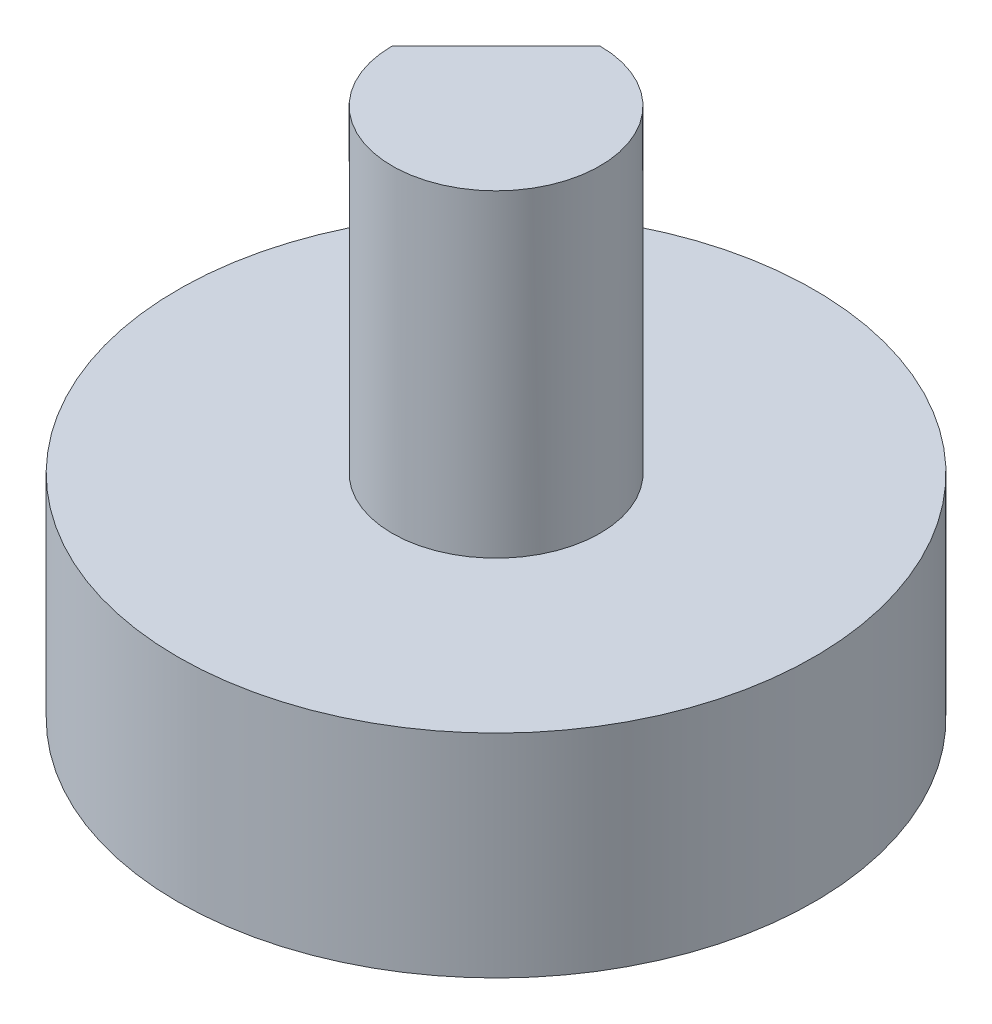
ISO-10303-21;
HEADER;
FILE_DESCRIPTION(('STEP AP214'),'2;1');
FILE_NAME('part.step','',(''),(''),'','','');
FILE_SCHEMA(('AUTOMOTIVE_DESIGN { 1 0 10303 214 1 1 1 1 }'));
ENDSEC;
DATA;
#1=APPLICATION_CONTEXT('core data for automotive mechanical design processes');
#2=APPLICATION_PROTOCOL_DEFINITION('international standard','automotive_design',2000,#1);
#3=PRODUCT_CONTEXT('',#1,'mechanical');
#4=PRODUCT('Part','Part','',(#3));
#5=PRODUCT_RELATED_PRODUCT_CATEGORY('part','',(#4));
#6=PRODUCT_DEFINITION_FORMATION('','',#4);
#7=PRODUCT_DEFINITION_CONTEXT('part definition',#1,'design');
#8=PRODUCT_DEFINITION('design','',#6,#7);
#9=PRODUCT_DEFINITION_SHAPE('','',#8);
#10=(LENGTH_UNIT() NAMED_UNIT(*) SI_UNIT(.MILLI.,.METRE.));
#11=(NAMED_UNIT(*) PLANE_ANGLE_UNIT() SI_UNIT($,.RADIAN.));
#12=(NAMED_UNIT(*) SI_UNIT($,.STERADIAN.) SOLID_ANGLE_UNIT());
#13=UNCERTAINTY_MEASURE_WITH_UNIT(LENGTH_MEASURE(1.E-05),#10,'distance_accuracy_value','');
#14=(GEOMETRIC_REPRESENTATION_CONTEXT(3) GLOBAL_UNCERTAINTY_ASSIGNED_CONTEXT((#13)) GLOBAL_UNIT_ASSIGNED_CONTEXT((#10,
#11,#12)) REPRESENTATION_CONTEXT('',''));
#15=CARTESIAN_POINT('',(0.,0.,0.));
#16=DIRECTION('',(0.,0.,1.));
#17=DIRECTION('',(1.,0.,0.));
#18=AXIS2_PLACEMENT_3D('',#15,#16,#17);
#19=CARTESIAN_POINT('',(0.,10.,0.));
#20=DIRECTION('',(0.,-1.,0.));
#21=DIRECTION('',(0.,0.,-1.));
#22=AXIS2_PLACEMENT_3D('',#19,#20,#21);
#23=CYLINDRICAL_SURFACE('',#22,15.);
#24=CARTESIAN_POINT('',(0.,10.,0.));
#25=DIRECTION('',(0.,1.,0.));
#26=DIRECTION('',(0.,0.,1.));
#27=AXIS2_PLACEMENT_3D('',#24,#25,#26);
#28=CIRCLE('',#27,15.);
#29=CARTESIAN_POINT('',(0.,10.,15.));
#30=VERTEX_POINT('',#29);
#31=EDGE_CURVE('E48',#30,#30,#28,.T.);
#32=ORIENTED_EDGE('',*,*,#31,.F.);
#33=EDGE_LOOP('',(#32));
#34=FACE_BOUND('',#33,.T.);
#35=CARTESIAN_POINT('',(0.,0.,0.));
#36=DIRECTION('',(0.,1.,0.));
#37=DIRECTION('',(0.,0.,1.));
#38=AXIS2_PLACEMENT_3D('',#35,#36,#37);
#39=CIRCLE('',#38,15.);
#40=CARTESIAN_POINT('',(0.,0.,15.));
#41=VERTEX_POINT('',#40);
#42=EDGE_CURVE('E42',#41,#41,#39,.T.);
#43=ORIENTED_EDGE('',*,*,#42,.T.);
#44=EDGE_LOOP('',(#43));
#45=FACE_BOUND('',#44,.T.);
#46=ADVANCED_FACE('F39',(#34,#45),#23,.T.);
#47=CARTESIAN_POINT('',(0.,10.,0.));
#48=DIRECTION('',(0.,1.,0.));
#49=DIRECTION('',(0.,0.,1.));
#50=AXIS2_PLACEMENT_3D('',#47,#48,#49);
#51=PLANE('',#50);
#52=CARTESIAN_POINT('',(0.,10.,0.));
#53=DIRECTION('',(0.,1.,0.));
#54=DIRECTION('',(0.,0.,1.));
#55=AXIS2_PLACEMENT_3D('',#52,#53,#54);
#56=CIRCLE('',#55,4.9);
#57=CARTESIAN_POINT('',(0.,10.,4.9));
#58=VERTEX_POINT('',#57);
#59=EDGE_CURVE('E11',#58,#58,#56,.T.);
#60=ORIENTED_EDGE('',*,*,#59,.F.);
#61=EDGE_LOOP('',(#60));
#62=FACE_BOUND('',#61,.T.);
#63=ORIENTED_EDGE('',*,*,#31,.T.);
#64=EDGE_LOOP('',(#63));
#65=FACE_BOUND('',#64,.T.);
#66=ADVANCED_FACE('F92',(#62,#65),#51,.T.);
#67=CARTESIAN_POINT('',(0.,0.,0.));
#68=DIRECTION('',(0.,1.,0.));
#69=DIRECTION('',(0.,0.,1.));
#70=AXIS2_PLACEMENT_3D('',#67,#68,#69);
#71=PLANE('',#70);
#72=ORIENTED_EDGE('',*,*,#42,.F.);
#73=EDGE_LOOP('',(#72));
#74=FACE_BOUND('',#73,.T.);
#75=ADVANCED_FACE('F98',(#74),#71,.F.);
#76=CARTESIAN_POINT('',(0.,25.,0.));
#77=DIRECTION('',(0.,-1.,0.));
#78=DIRECTION('',(0.,0.,-1.));
#79=AXIS2_PLACEMENT_3D('',#76,#77,#78);
#80=CYLINDRICAL_SURFACE('',#79,4.9);
#81=CARTESIAN_POINT('',(0.,25.,0.));
#82=DIRECTION('',(0.,1.,0.));
#83=DIRECTION('',(0.,0.,1.));
#84=AXIS2_PLACEMENT_3D('',#81,#82,#83);
#85=CIRCLE('',#84,4.9);
#86=CARTESIAN_POINT('',(-4.9,25.,0.));
#87=VERTEX_POINT('',#86);
#88=CARTESIAN_POINT('',(0.,25.,-4.9));
#89=VERTEX_POINT('',#88);
#90=EDGE_CURVE('E79',#87,#89,#85,.T.);
#91=ORIENTED_EDGE('',*,*,#90,.F.);
#92=DIRECTION('',(0.,1.,0.));
#93=VECTOR('',#92,1.);
#94=CARTESIAN_POINT('',(-4.9,21.,0.));
#95=LINE('',#94,#93);
#96=CARTESIAN_POINT('',(-4.9,21.,0.));
#97=VERTEX_POINT('',#96);
#98=EDGE_CURVE('E56',#97,#87,#95,.T.);
#99=ORIENTED_EDGE('',*,*,#98,.F.);
#100=CARTESIAN_POINT('',(0.,21.,0.));
#101=DIRECTION('',(0.,1.,0.));
#102=DIRECTION('',(0.,0.,1.));
#103=AXIS2_PLACEMENT_3D('',#100,#101,#102);
#104=CIRCLE('',#103,4.9);
#105=CARTESIAN_POINT('',(0.,21.,-4.9));
#106=VERTEX_POINT('',#105);
#107=EDGE_CURVE('E73',#106,#97,#104,.T.);
#108=ORIENTED_EDGE('',*,*,#107,.F.);
#109=DIRECTION('',(0.,1.,0.));
#110=VECTOR('',#109,1.);
#111=CARTESIAN_POINT('',(0.,21.,-4.9));
#112=LINE('',#111,#110);
#113=EDGE_CURVE('E62',#106,#89,#112,.T.);
#114=ORIENTED_EDGE('',*,*,#113,.T.);
#115=EDGE_LOOP('',(#91,#99,#108,#114));
#116=FACE_BOUND('',#115,.T.);
#117=ORIENTED_EDGE('',*,*,#59,.T.);
#118=EDGE_LOOP('',(#117));
#119=FACE_BOUND('',#118,.T.);
#120=ADVANCED_FACE('F77',(#116,#119),#80,.T.);
#121=CARTESIAN_POINT('',(0.,25.,0.));
#122=DIRECTION('',(0.,1.,0.));
#123=DIRECTION('',(0.,0.,1.));
#124=AXIS2_PLACEMENT_3D('',#121,#122,#123);
#125=PLANE('',#124);
#126=DIRECTION('',(0.707106781186548,0.,-0.707106781186548));
#127=VECTOR('',#126,1.);
#128=CARTESIAN_POINT('',(-4.9,25.,0.));
#129=LINE('',#128,#127);
#130=EDGE_CURVE('E67',#87,#89,#129,.T.);
#131=ORIENTED_EDGE('',*,*,#130,.F.);
#132=ORIENTED_EDGE('',*,*,#90,.T.);
#133=EDGE_LOOP('',(#131,#132));
#134=FACE_BOUND('',#133,.T.);
#135=ADVANCED_FACE('F82',(#134),#125,.T.);
#136=CARTESIAN_POINT('',(-4.9,21.,0.));
#137=DIRECTION('',(0.707106781186547,0.,0.707106781186547));
#138=DIRECTION('',(0.707106781186548,0.,-0.707106781186548));
#139=AXIS2_PLACEMENT_3D('',#136,#137,#138);
#140=PLANE('',#139);
#141=ORIENTED_EDGE('',*,*,#130,.T.);
#142=ORIENTED_EDGE('',*,*,#113,.F.);
#143=DIRECTION('',(0.707106781186548,0.,-0.707106781186548));
#144=VECTOR('',#143,1.);
#145=CARTESIAN_POINT('',(-4.9,21.,0.));
#146=LINE('',#145,#144);
#147=EDGE_CURVE('E117',#97,#106,#146,.T.);
#148=ORIENTED_EDGE('',*,*,#147,.F.);
#149=ORIENTED_EDGE('',*,*,#98,.T.);
#150=EDGE_LOOP('',(#141,#142,#148,#149));
#151=FACE_BOUND('',#150,.T.);
#152=ADVANCED_FACE('F68',(#151),#140,.F.);
#153=CARTESIAN_POINT('',(0.,21.,0.));
#154=DIRECTION('',(0.,1.,0.));
#155=DIRECTION('',(0.,0.,1.));
#156=AXIS2_PLACEMENT_3D('',#153,#154,#155);
#157=PLANE('',#156);
#158=ORIENTED_EDGE('',*,*,#107,.T.);
#159=ORIENTED_EDGE('',*,*,#147,.T.);
#160=EDGE_LOOP('',(#158,#159));
#161=FACE_BOUND('',#160,.T.);
#162=ADVANCED_FACE('F112',(#161),#157,.T.);
#163=CLOSED_SHELL('',(#46,#66,#75,#120,#135,#152,#162));
#164=MANIFOLD_SOLID_BREP('B2',#163);
#165=ADVANCED_BREP_SHAPE_REPRESENTATION('',(#18,#164),#14);
#166=SHAPE_DEFINITION_REPRESENTATION(#9,#165);
ENDSEC;
END-ISO-10303-21;
